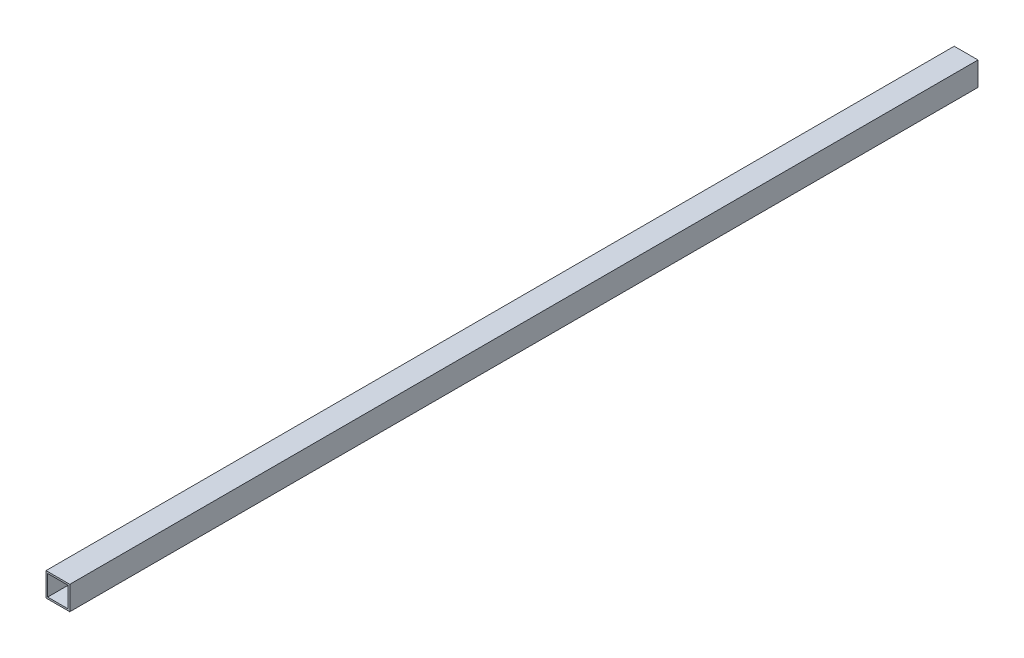
ISO-10303-21;
HEADER;
FILE_DESCRIPTION(('STEP AP214'),'2;1');
FILE_NAME('part.step','',(''),(''),'','','');
FILE_SCHEMA(('AUTOMOTIVE_DESIGN { 1 0 10303 214 1 1 1 1 }'));
ENDSEC;
DATA;
#1=APPLICATION_CONTEXT('core data for automotive mechanical design processes');
#2=APPLICATION_PROTOCOL_DEFINITION('international standard','automotive_design',2000,#1);
#3=PRODUCT_CONTEXT('',#1,'mechanical');
#4=PRODUCT('Part','Part','',(#3));
#5=PRODUCT_RELATED_PRODUCT_CATEGORY('part','',(#4));
#6=PRODUCT_DEFINITION_FORMATION('','',#4);
#7=PRODUCT_DEFINITION_CONTEXT('part definition',#1,'design');
#8=PRODUCT_DEFINITION('design','',#6,#7);
#9=PRODUCT_DEFINITION_SHAPE('','',#8);
#10=(LENGTH_UNIT() NAMED_UNIT(*) SI_UNIT(.MILLI.,.METRE.));
#11=(NAMED_UNIT(*) PLANE_ANGLE_UNIT() SI_UNIT($,.RADIAN.));
#12=(NAMED_UNIT(*) SI_UNIT($,.STERADIAN.) SOLID_ANGLE_UNIT());
#13=UNCERTAINTY_MEASURE_WITH_UNIT(LENGTH_MEASURE(1.E-05),#10,'distance_accuracy_value','');
#14=(GEOMETRIC_REPRESENTATION_CONTEXT(3) GLOBAL_UNCERTAINTY_ASSIGNED_CONTEXT((#13)) GLOBAL_UNIT_ASSIGNED_CONTEXT((#10,
#11,#12)) REPRESENTATION_CONTEXT('',''));
#15=CARTESIAN_POINT('',(0.,0.,0.));
#16=DIRECTION('',(0.,0.,1.));
#17=DIRECTION('',(1.,0.,0.));
#18=AXIS2_PLACEMENT_3D('',#15,#16,#17);
#19=CARTESIAN_POINT('',(0.,0.,649.));
#20=DIRECTION('',(0.,0.,-1.));
#21=DIRECTION('',(-1.,0.,0.));
#22=AXIS2_PLACEMENT_3D('',#19,#20,#21);
#23=PLANE('',#22);
#24=DIRECTION('',(0.,1.,0.));
#25=VECTOR('',#24,1.);
#26=CARTESIAN_POINT('',(8.5,-8.5,649.));
#27=LINE('',#26,#25);
#28=CARTESIAN_POINT('',(8.5,-8.5,649.));
#29=VERTEX_POINT('',#28);
#30=CARTESIAN_POINT('',(8.5,8.5,649.));
#31=VERTEX_POINT('',#30);
#32=EDGE_CURVE('E153',#29,#31,#27,.T.);
#33=ORIENTED_EDGE('',*,*,#32,.T.);
#34=DIRECTION('',(-1.,0.,0.));
#35=VECTOR('',#34,1.);
#36=CARTESIAN_POINT('',(-8.5,8.5,649.));
#37=LINE('',#36,#35);
#38=CARTESIAN_POINT('',(-8.5,8.5,649.));
#39=VERTEX_POINT('',#38);
#40=EDGE_CURVE('E157',#31,#39,#37,.T.);
#41=ORIENTED_EDGE('',*,*,#40,.T.);
#42=DIRECTION('',(0.,-1.,0.));
#43=VECTOR('',#42,1.);
#44=CARTESIAN_POINT('',(-8.5,-8.5,649.));
#45=LINE('',#44,#43);
#46=CARTESIAN_POINT('',(-8.5,-8.5,649.));
#47=VERTEX_POINT('',#46);
#48=EDGE_CURVE('E161',#39,#47,#45,.T.);
#49=ORIENTED_EDGE('',*,*,#48,.T.);
#50=DIRECTION('',(1.,0.,0.));
#51=VECTOR('',#50,1.);
#52=CARTESIAN_POINT('',(-8.5,-8.5,649.));
#53=LINE('',#52,#51);
#54=EDGE_CURVE('E164',#47,#29,#53,.T.);
#55=ORIENTED_EDGE('',*,*,#54,.T.);
#56=EDGE_LOOP('',(#33,#41,#49,#55));
#57=FACE_BOUND('',#56,.T.);
#58=DIRECTION('',(0.,-1.,0.));
#59=VECTOR('',#58,1.);
#60=CARTESIAN_POINT('',(-7.3,-7.3,649.));
#61=LINE('',#60,#59);
#62=CARTESIAN_POINT('',(-7.3,7.3,649.));
#63=VERTEX_POINT('',#62);
#64=CARTESIAN_POINT('',(-7.3,-7.3,649.));
#65=VERTEX_POINT('',#64);
#66=EDGE_CURVE('E105',#63,#65,#61,.T.);
#67=ORIENTED_EDGE('',*,*,#66,.F.);
#68=DIRECTION('',(-1.,0.,0.));
#69=VECTOR('',#68,1.);
#70=CARTESIAN_POINT('',(-7.3,7.3,649.));
#71=LINE('',#70,#69);
#72=CARTESIAN_POINT('',(7.3,7.3,649.));
#73=VERTEX_POINT('',#72);
#74=EDGE_CURVE('E131',#73,#63,#71,.T.);
#75=ORIENTED_EDGE('',*,*,#74,.F.);
#76=DIRECTION('',(0.,1.,0.));
#77=VECTOR('',#76,1.);
#78=CARTESIAN_POINT('',(7.3,-7.3,649.));
#79=LINE('',#78,#77);
#80=CARTESIAN_POINT('',(7.3,-7.3,649.));
#81=VERTEX_POINT('',#80);
#82=EDGE_CURVE('E127',#81,#73,#79,.T.);
#83=ORIENTED_EDGE('',*,*,#82,.F.);
#84=DIRECTION('',(1.,0.,0.));
#85=VECTOR('',#84,1.);
#86=CARTESIAN_POINT('',(-7.3,-7.3,649.));
#87=LINE('',#86,#85);
#88=EDGE_CURVE('E114',#65,#81,#87,.T.);
#89=ORIENTED_EDGE('',*,*,#88,.F.);
#90=EDGE_LOOP('',(#67,#75,#83,#89));
#91=FACE_BOUND('',#90,.T.);
#92=ADVANCED_FACE('F39',(#57,#91),#23,.F.);
#93=CARTESIAN_POINT('',(0.,0.,0.));
#94=DIRECTION('',(0.,0.,-1.));
#95=DIRECTION('',(-1.,0.,0.));
#96=AXIS2_PLACEMENT_3D('',#93,#94,#95);
#97=PLANE('',#96);
#98=DIRECTION('',(0.,1.,0.));
#99=VECTOR('',#98,1.);
#100=CARTESIAN_POINT('',(8.5,-8.5,0.));
#101=LINE('',#100,#99);
#102=CARTESIAN_POINT('',(8.5,-8.5,0.));
#103=VERTEX_POINT('',#102);
#104=CARTESIAN_POINT('',(8.5,8.5,0.));
#105=VERTEX_POINT('',#104);
#106=EDGE_CURVE('E123',#103,#105,#101,.T.);
#107=ORIENTED_EDGE('',*,*,#106,.F.);
#108=DIRECTION('',(1.,0.,0.));
#109=VECTOR('',#108,1.);
#110=CARTESIAN_POINT('',(-8.5,-8.5,0.));
#111=LINE('',#110,#109);
#112=CARTESIAN_POINT('',(-8.5,-8.5,0.));
#113=VERTEX_POINT('',#112);
#114=EDGE_CURVE('E158',#113,#103,#111,.T.);
#115=ORIENTED_EDGE('',*,*,#114,.F.);
#116=DIRECTION('',(0.,-1.,0.));
#117=VECTOR('',#116,1.);
#118=CARTESIAN_POINT('',(-8.5,-8.5,0.));
#119=LINE('',#118,#117);
#120=CARTESIAN_POINT('',(-8.5,8.5,0.));
#121=VERTEX_POINT('',#120);
#122=EDGE_CURVE('E174',#121,#113,#119,.T.);
#123=ORIENTED_EDGE('',*,*,#122,.F.);
#124=DIRECTION('',(-1.,0.,0.));
#125=VECTOR('',#124,1.);
#126=CARTESIAN_POINT('',(-8.5,8.5,0.));
#127=LINE('',#126,#125);
#128=EDGE_CURVE('E171',#105,#121,#127,.T.);
#129=ORIENTED_EDGE('',*,*,#128,.F.);
#130=EDGE_LOOP('',(#107,#115,#123,#129));
#131=FACE_BOUND('',#130,.T.);
#132=DIRECTION('',(-1.,0.,0.));
#133=VECTOR('',#132,1.);
#134=CARTESIAN_POINT('',(-7.3,7.3,0.));
#135=LINE('',#134,#133);
#136=CARTESIAN_POINT('',(7.3,7.3,0.));
#137=VERTEX_POINT('',#136);
#138=CARTESIAN_POINT('',(-7.3,7.3,0.));
#139=VERTEX_POINT('',#138);
#140=EDGE_CURVE('E115',#137,#139,#135,.T.);
#141=ORIENTED_EDGE('',*,*,#140,.T.);
#142=DIRECTION('',(0.,-1.,0.));
#143=VECTOR('',#142,1.);
#144=CARTESIAN_POINT('',(-7.3,-7.3,0.));
#145=LINE('',#144,#143);
#146=CARTESIAN_POINT('',(-7.3,-7.3,0.));
#147=VERTEX_POINT('',#146);
#148=EDGE_CURVE('E63',#139,#147,#145,.T.);
#149=ORIENTED_EDGE('',*,*,#148,.T.);
#150=DIRECTION('',(1.,0.,0.));
#151=VECTOR('',#150,1.);
#152=CARTESIAN_POINT('',(-7.3,-7.3,0.));
#153=LINE('',#152,#151);
#154=CARTESIAN_POINT('',(7.3,-7.3,0.));
#155=VERTEX_POINT('',#154);
#156=EDGE_CURVE('E121',#147,#155,#153,.T.);
#157=ORIENTED_EDGE('',*,*,#156,.T.);
#158=DIRECTION('',(0.,1.,0.));
#159=VECTOR('',#158,1.);
#160=CARTESIAN_POINT('',(7.3,-7.3,0.));
#161=LINE('',#160,#159);
#162=EDGE_CURVE('E140',#155,#137,#161,.T.);
#163=ORIENTED_EDGE('',*,*,#162,.T.);
#164=EDGE_LOOP('',(#141,#149,#157,#163));
#165=FACE_BOUND('',#164,.T.);
#166=ADVANCED_FACE('F197',(#131,#165),#97,.T.);
#167=CARTESIAN_POINT('',(8.5,-8.5,649.));
#168=DIRECTION('',(-1.,0.,0.));
#169=DIRECTION('',(0.,0.,1.));
#170=AXIS2_PLACEMENT_3D('',#167,#168,#169);
#171=PLANE('',#170);
#172=ORIENTED_EDGE('',*,*,#106,.T.);
#173=DIRECTION('',(0.,0.,-1.));
#174=VECTOR('',#173,1.);
#175=CARTESIAN_POINT('',(8.5,8.5,649.));
#176=LINE('',#175,#174);
#177=EDGE_CURVE('E11',#31,#105,#176,.T.);
#178=ORIENTED_EDGE('',*,*,#177,.F.);
#179=ORIENTED_EDGE('',*,*,#32,.F.);
#180=DIRECTION('',(0.,0.,-1.));
#181=VECTOR('',#180,1.);
#182=CARTESIAN_POINT('',(8.5,-8.5,649.));
#183=LINE('',#182,#181);
#184=EDGE_CURVE('E167',#29,#103,#183,.T.);
#185=ORIENTED_EDGE('',*,*,#184,.T.);
#186=EDGE_LOOP('',(#172,#178,#179,#185));
#187=FACE_BOUND('',#186,.T.);
#188=ADVANCED_FACE('F41',(#187),#171,.F.);
#189=CARTESIAN_POINT('',(-8.5,8.5,649.));
#190=DIRECTION('',(0.,-1.,0.));
#191=DIRECTION('',(0.,0.,-1.));
#192=AXIS2_PLACEMENT_3D('',#189,#190,#191);
#193=PLANE('',#192);
#194=ORIENTED_EDGE('',*,*,#128,.T.);
#195=DIRECTION('',(0.,0.,-1.));
#196=VECTOR('',#195,1.);
#197=CARTESIAN_POINT('',(-8.5,8.5,649.));
#198=LINE('',#197,#196);
#199=EDGE_CURVE('E48',#39,#121,#198,.T.);
#200=ORIENTED_EDGE('',*,*,#199,.F.);
#201=ORIENTED_EDGE('',*,*,#40,.F.);
#202=ORIENTED_EDGE('',*,*,#177,.T.);
#203=EDGE_LOOP('',(#194,#200,#201,#202));
#204=FACE_BOUND('',#203,.T.);
#205=ADVANCED_FACE('F207',(#204),#193,.F.);
#206=CARTESIAN_POINT('',(-8.5,-8.5,649.));
#207=DIRECTION('',(1.,0.,0.));
#208=DIRECTION('',(0.,0.,-1.));
#209=AXIS2_PLACEMENT_3D('',#206,#207,#208);
#210=PLANE('',#209);
#211=ORIENTED_EDGE('',*,*,#122,.T.);
#212=DIRECTION('',(0.,0.,-1.));
#213=VECTOR('',#212,1.);
#214=CARTESIAN_POINT('',(-8.5,-8.5,649.));
#215=LINE('',#214,#213);
#216=EDGE_CURVE('E182',#47,#113,#215,.T.);
#217=ORIENTED_EDGE('',*,*,#216,.F.);
#218=ORIENTED_EDGE('',*,*,#48,.F.);
#219=ORIENTED_EDGE('',*,*,#199,.T.);
#220=EDGE_LOOP('',(#211,#217,#218,#219));
#221=FACE_BOUND('',#220,.T.);
#222=ADVANCED_FACE('F191',(#221),#210,.F.);
#223=CARTESIAN_POINT('',(-8.5,-8.5,649.));
#224=DIRECTION('',(0.,1.,0.));
#225=DIRECTION('',(0.,0.,1.));
#226=AXIS2_PLACEMENT_3D('',#223,#224,#225);
#227=PLANE('',#226);
#228=ORIENTED_EDGE('',*,*,#114,.T.);
#229=ORIENTED_EDGE('',*,*,#184,.F.);
#230=ORIENTED_EDGE('',*,*,#54,.F.);
#231=ORIENTED_EDGE('',*,*,#216,.T.);
#232=EDGE_LOOP('',(#228,#229,#230,#231));
#233=FACE_BOUND('',#232,.T.);
#234=ADVANCED_FACE('F201',(#233),#227,.F.);
#235=CARTESIAN_POINT('',(-7.3,-7.3,649.));
#236=DIRECTION('',(1.,0.,0.));
#237=DIRECTION('',(0.,0.,-1.));
#238=AXIS2_PLACEMENT_3D('',#235,#236,#237);
#239=PLANE('',#238);
#240=ORIENTED_EDGE('',*,*,#148,.F.);
#241=DIRECTION('',(0.,0.,-1.));
#242=VECTOR('',#241,1.);
#243=CARTESIAN_POINT('',(-7.3,7.3,649.));
#244=LINE('',#243,#242);
#245=EDGE_CURVE('E109',#63,#139,#244,.T.);
#246=ORIENTED_EDGE('',*,*,#245,.F.);
#247=ORIENTED_EDGE('',*,*,#66,.T.);
#248=DIRECTION('',(0.,0.,-1.));
#249=VECTOR('',#248,1.);
#250=CARTESIAN_POINT('',(-7.3,-7.3,649.));
#251=LINE('',#250,#249);
#252=EDGE_CURVE('E108',#65,#147,#251,.T.);
#253=ORIENTED_EDGE('',*,*,#252,.T.);
#254=EDGE_LOOP('',(#240,#246,#247,#253));
#255=FACE_BOUND('',#254,.T.);
#256=ADVANCED_FACE('F107',(#255),#239,.T.);
#257=CARTESIAN_POINT('',(-7.3,-7.3,649.));
#258=DIRECTION('',(0.,1.,0.));
#259=DIRECTION('',(0.,0.,1.));
#260=AXIS2_PLACEMENT_3D('',#257,#258,#259);
#261=PLANE('',#260);
#262=ORIENTED_EDGE('',*,*,#156,.F.);
#263=ORIENTED_EDGE('',*,*,#252,.F.);
#264=ORIENTED_EDGE('',*,*,#88,.T.);
#265=DIRECTION('',(0.,0.,-1.));
#266=VECTOR('',#265,1.);
#267=CARTESIAN_POINT('',(7.3,-7.3,649.));
#268=LINE('',#267,#266);
#269=EDGE_CURVE('E124',#81,#155,#268,.T.);
#270=ORIENTED_EDGE('',*,*,#269,.T.);
#271=EDGE_LOOP('',(#262,#263,#264,#270));
#272=FACE_BOUND('',#271,.T.);
#273=ADVANCED_FACE('F118',(#272),#261,.T.);
#274=CARTESIAN_POINT('',(7.3,-7.3,649.));
#275=DIRECTION('',(-1.,0.,0.));
#276=DIRECTION('',(0.,0.,1.));
#277=AXIS2_PLACEMENT_3D('',#274,#275,#276);
#278=PLANE('',#277);
#279=ORIENTED_EDGE('',*,*,#162,.F.);
#280=ORIENTED_EDGE('',*,*,#269,.F.);
#281=ORIENTED_EDGE('',*,*,#82,.T.);
#282=DIRECTION('',(0.,0.,-1.));
#283=VECTOR('',#282,1.);
#284=CARTESIAN_POINT('',(7.3,7.3,649.));
#285=LINE('',#284,#283);
#286=EDGE_CURVE('E55',#73,#137,#285,.T.);
#287=ORIENTED_EDGE('',*,*,#286,.T.);
#288=EDGE_LOOP('',(#279,#280,#281,#287));
#289=FACE_BOUND('',#288,.T.);
#290=ADVANCED_FACE('F230',(#289),#278,.T.);
#291=CARTESIAN_POINT('',(-7.3,7.3,649.));
#292=DIRECTION('',(0.,-1.,0.));
#293=DIRECTION('',(0.,0.,-1.));
#294=AXIS2_PLACEMENT_3D('',#291,#292,#293);
#295=PLANE('',#294);
#296=ORIENTED_EDGE('',*,*,#140,.F.);
#297=ORIENTED_EDGE('',*,*,#286,.F.);
#298=ORIENTED_EDGE('',*,*,#74,.T.);
#299=ORIENTED_EDGE('',*,*,#245,.T.);
#300=EDGE_LOOP('',(#296,#297,#298,#299));
#301=FACE_BOUND('',#300,.T.);
#302=ADVANCED_FACE('F234',(#301),#295,.T.);
#303=CLOSED_SHELL('',(#92,#166,#188,#205,#222,#234,#256,#273,#290,#302));
#304=MANIFOLD_SOLID_BREP('B2',#303);
#305=ADVANCED_BREP_SHAPE_REPRESENTATION('',(#18,#304),#14);
#306=SHAPE_DEFINITION_REPRESENTATION(#9,#305);
ENDSEC;
END-ISO-10303-21;
